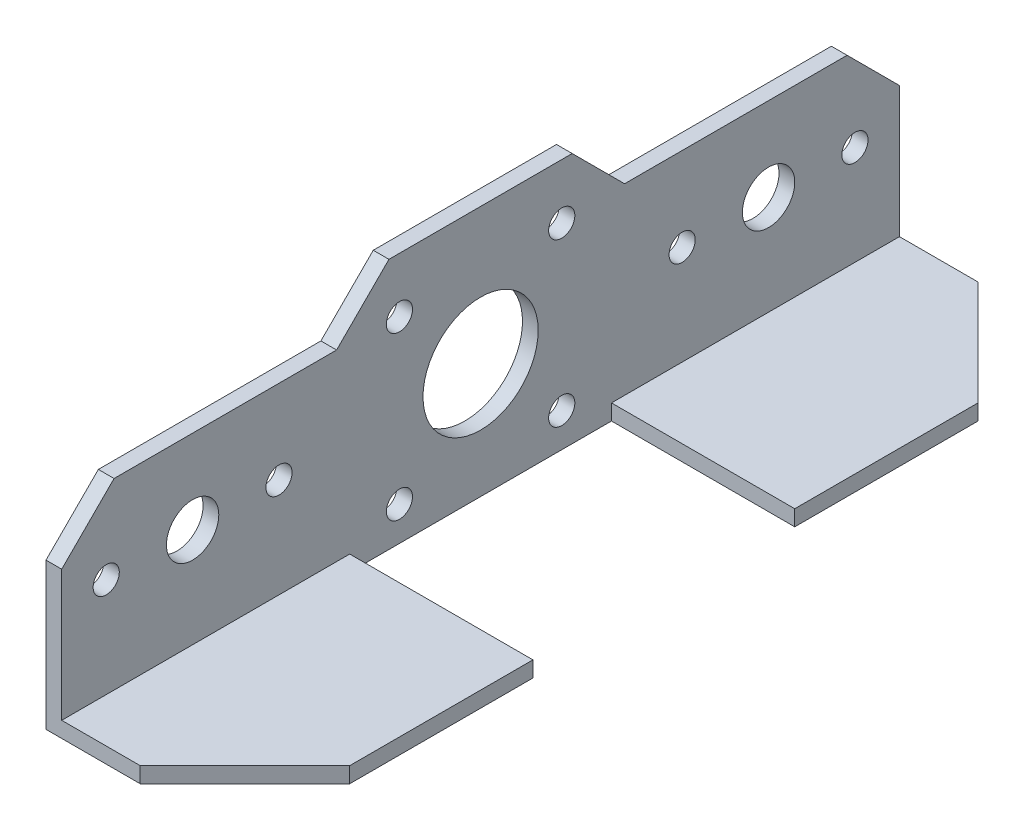
ISO-10303-21;
HEADER;
FILE_DESCRIPTION(('STEP AP214'),'2;1');
FILE_NAME('part.step','',(''),(''),'','','');
FILE_SCHEMA(('AUTOMOTIVE_DESIGN { 1 0 10303 214 1 1 1 1 }'));
ENDSEC;
DATA;
#1=APPLICATION_CONTEXT('core data for automotive mechanical design processes');
#2=APPLICATION_PROTOCOL_DEFINITION('international standard','automotive_design',2000,#1);
#3=PRODUCT_CONTEXT('',#1,'mechanical');
#4=PRODUCT('Part','Part','',(#3));
#5=PRODUCT_RELATED_PRODUCT_CATEGORY('part','',(#4));
#6=PRODUCT_DEFINITION_FORMATION('','',#4);
#7=PRODUCT_DEFINITION_CONTEXT('part definition',#1,'design');
#8=PRODUCT_DEFINITION('design','',#6,#7);
#9=PRODUCT_DEFINITION_SHAPE('','',#8);
#10=(LENGTH_UNIT() NAMED_UNIT(*) SI_UNIT(.MILLI.,.METRE.));
#11=(NAMED_UNIT(*) PLANE_ANGLE_UNIT() SI_UNIT($,.RADIAN.));
#12=(NAMED_UNIT(*) SI_UNIT($,.STERADIAN.) SOLID_ANGLE_UNIT());
#13=UNCERTAINTY_MEASURE_WITH_UNIT(LENGTH_MEASURE(1.E-05),#10,'distance_accuracy_value','');
#14=(GEOMETRIC_REPRESENTATION_CONTEXT(3) GLOBAL_UNCERTAINTY_ASSIGNED_CONTEXT((#13)) GLOBAL_UNIT_ASSIGNED_CONTEXT((#10,
#11,#12)) REPRESENTATION_CONTEXT('',''));
#15=CARTESIAN_POINT('',(0.,0.,0.));
#16=DIRECTION('',(0.,0.,1.));
#17=DIRECTION('',(1.,0.,0.));
#18=AXIS2_PLACEMENT_3D('',#15,#16,#17);
#19=CARTESIAN_POINT('',(1.66533453693773E-13,38.0000000000002,-79.9999999999998));
#20=DIRECTION('',(0.,1.00000000000001,0.));
#21=DIRECTION('',(0.,0.,1.));
#22=AXIS2_PLACEMENT_3D('',#19,#20,#21);
#23=PLANE('',#22);
#24=DIRECTION('',(0.,0.,1.));
#25=VECTOR('',#24,1.);
#26=CARTESIAN_POINT('',(1.66533453693773E-13,38.0000000000002,-79.9999999999998));
#27=LINE('',#26,#25);
#28=CARTESIAN_POINT('',(0.,38.0000000000002,27.5));
#29=VERTEX_POINT('',#28);
#30=CARTESIAN_POINT('',(-3.33066907387547E-13,38.0000000000002,70.));
#31=VERTEX_POINT('',#30);
#32=EDGE_CURVE('E192',#29,#31,#27,.T.);
#33=ORIENTED_EDGE('',*,*,#32,.T.);
#34=DIRECTION('',(1.00000000000001,0.,0.));
#35=VECTOR('',#34,1.);
#36=CARTESIAN_POINT('',(2.99999999999967,38.0000000000002,70.));
#37=LINE('',#36,#35);
#38=CARTESIAN_POINT('',(2.99999999999967,38.0000000000002,70.));
#39=VERTEX_POINT('',#38);
#40=EDGE_CURVE('E321',#31,#39,#37,.T.);
#41=ORIENTED_EDGE('',*,*,#40,.T.);
#42=DIRECTION('',(0.,0.,1.));
#43=VECTOR('',#42,1.);
#44=CARTESIAN_POINT('',(3.00000000000017,38.0000000000002,-79.9999999999997));
#45=LINE('',#44,#43);
#46=CARTESIAN_POINT('',(3.,38.0000000000002,27.5));
#47=VERTEX_POINT('',#46);
#48=EDGE_CURVE('E287',#47,#39,#45,.T.);
#49=ORIENTED_EDGE('',*,*,#48,.F.);
#50=DIRECTION('',(-1.00000000000001,0.,0.));
#51=VECTOR('',#50,1.);
#52=CARTESIAN_POINT('',(58.9016994374957,38.0000000000002,27.5000000000003));
#53=LINE('',#52,#51);
#54=EDGE_CURVE('E195',#47,#29,#53,.T.);
#55=ORIENTED_EDGE('',*,*,#54,.T.);
#56=EDGE_LOOP('',(#33,#41,#49,#55));
#57=FACE_BOUND('',#56,.T.);
#58=ADVANCED_FACE('F42',(#57),#23,.T.);
#59=CARTESIAN_POINT('',(3.00000000000017,3.,-79.9999999999997));
#60=DIRECTION('',(0.,1.00000000000001,0.));
#61=DIRECTION('',(0.,0.,1.));
#62=AXIS2_PLACEMENT_3D('',#59,#60,#61);
#63=PLANE('',#62);
#64=DIRECTION('',(-1.00000000000001,0.,0.));
#65=VECTOR('',#64,1.);
#66=CARTESIAN_POINT('',(3.,3.00000000000001,80.));
#67=LINE('',#66,#65);
#68=CARTESIAN_POINT('',(18.,3.00000000000001,80.));
#69=VERTEX_POINT('',#68);
#70=CARTESIAN_POINT('',(3.,3.00000000000001,80.));
#71=VERTEX_POINT('',#70);
#72=EDGE_CURVE('E265',#69,#71,#67,.T.);
#73=ORIENTED_EDGE('',*,*,#72,.F.);
#74=DIRECTION('',(0.707106781186549,0.,-0.707106781186549));
#75=VECTOR('',#74,1.);
#76=CARTESIAN_POINT('',(90.5000000000006,3.,7.50000000000001));
#77=LINE('',#76,#75);
#78=CARTESIAN_POINT('',(38.0000000000003,3.00000000000002,60.));
#79=VERTEX_POINT('',#78);
#80=EDGE_CURVE('E310',#69,#79,#77,.T.);
#81=ORIENTED_EDGE('',*,*,#80,.T.);
#82=DIRECTION('',(0.,0.,1.));
#83=VECTOR('',#82,1.);
#84=CARTESIAN_POINT('',(38.0000000000006,3.,-79.9999999999997));
#85=LINE('',#84,#83);
#86=CARTESIAN_POINT('',(38.0000000000003,3.00000000000006,25.0000000000001));
#87=VERTEX_POINT('',#86);
#88=EDGE_CURVE('E294',#87,#79,#85,.T.);
#89=ORIENTED_EDGE('',*,*,#88,.F.);
#90=DIRECTION('',(1.00000000000001,0.,0.));
#91=VECTOR('',#90,1.);
#92=CARTESIAN_POINT('',(3.,3.00000000000006,25.));
#93=LINE('',#92,#91);
#94=CARTESIAN_POINT('',(3.,3.00000000000006,25.));
#95=VERTEX_POINT('',#94);
#96=EDGE_CURVE('E239',#95,#87,#93,.T.);
#97=ORIENTED_EDGE('',*,*,#96,.F.);
#98=DIRECTION('',(0.,0.,1.));
#99=VECTOR('',#98,1.);
#100=CARTESIAN_POINT('',(3.00000000000017,3.,-79.9999999999997));
#101=LINE('',#100,#99);
#102=EDGE_CURVE('E291',#95,#71,#101,.T.);
#103=ORIENTED_EDGE('',*,*,#102,.T.);
#104=EDGE_LOOP('',(#73,#81,#89,#97,#103));
#105=FACE_BOUND('',#104,.T.);
#106=ADVANCED_FACE('F357',(#105),#63,.T.);
#107=CARTESIAN_POINT('',(38.0000000000006,3.,-79.9999999999997));
#108=DIRECTION('',(1.00000000000001,0.,0.));
#109=DIRECTION('',(0.,0.,-1.));
#110=AXIS2_PLACEMENT_3D('',#107,#108,#109);
#111=PLANE('',#110);
#112=ORIENTED_EDGE('',*,*,#88,.T.);
#113=DIRECTION('',(0.,-1.00000000000001,0.));
#114=VECTOR('',#113,1.);
#115=CARTESIAN_POINT('',(38.0000000000003,0.,60.0000000000005));
#116=LINE('',#115,#114);
#117=CARTESIAN_POINT('',(38.0000000000003,0.,60.0000000000005));
#118=VERTEX_POINT('',#117);
#119=EDGE_CURVE('E312',#79,#118,#116,.T.);
#120=ORIENTED_EDGE('',*,*,#119,.T.);
#121=DIRECTION('',(0.,0.,1.));
#122=VECTOR('',#121,1.);
#123=CARTESIAN_POINT('',(38.0000000000006,0.,-80.));
#124=LINE('',#123,#122);
#125=CARTESIAN_POINT('',(38.0000000000003,0.,25.0000000000006));
#126=VERTEX_POINT('',#125);
#127=EDGE_CURVE('E281',#126,#118,#124,.T.);
#128=ORIENTED_EDGE('',*,*,#127,.F.);
#129=DIRECTION('',(0.,1.00000000000001,0.));
#130=VECTOR('',#129,1.);
#131=CARTESIAN_POINT('',(38.0000000000003,-61.0327780786689,25.0000000000001));
#132=LINE('',#131,#130);
#133=EDGE_CURVE('E255',#126,#87,#132,.T.);
#134=ORIENTED_EDGE('',*,*,#133,.T.);
#135=EDGE_LOOP('',(#112,#120,#128,#134));
#136=FACE_BOUND('',#135,.T.);
#137=ADVANCED_FACE('F364',(#136),#111,.T.);
#138=CARTESIAN_POINT('',(1.66533453693773E-13,0.,-80.));
#139=DIRECTION('',(0.,-1.00000000000001,0.));
#140=DIRECTION('',(0.,0.,-1.));
#141=AXIS2_PLACEMENT_3D('',#138,#139,#140);
#142=PLANE('',#141);
#143=DIRECTION('',(1.00000000000001,0.,0.));
#144=VECTOR('',#143,1.);
#145=CARTESIAN_POINT('',(1.66533453693773E-13,0.,-80.));
#146=LINE('',#145,#144);
#147=CARTESIAN_POINT('',(1.66533453693773E-13,0.,-80.));
#148=VERTEX_POINT('',#147);
#149=CARTESIAN_POINT('',(18.0000000000001,0.,-80.));
#150=VERTEX_POINT('',#149);
#151=EDGE_CURVE('E272',#148,#150,#146,.T.);
#152=ORIENTED_EDGE('',*,*,#151,.T.);
#153=DIRECTION('',(-0.707106781186551,0.,-0.707106781186546));
#154=VECTOR('',#153,1.);
#155=CARTESIAN_POINT('',(8.99999999999959,0.,-89.));
#156=LINE('',#155,#154);
#157=CARTESIAN_POINT('',(38.0000000000003,0.,-60.));
#158=VERTEX_POINT('',#157);
#159=EDGE_CURVE('E305',#150,#158,#156,.F.);
#160=ORIENTED_EDGE('',*,*,#159,.T.);
#161=CARTESIAN_POINT('',(38.,0.,-25.));
#162=VERTEX_POINT('',#161);
#163=EDGE_CURVE('E295',#158,#162,#124,.T.);
#164=ORIENTED_EDGE('',*,*,#163,.T.);
#165=DIRECTION('',(-1.00000000000001,0.,0.));
#166=VECTOR('',#165,1.);
#167=CARTESIAN_POINT('',(2.99999999999981,0.,-24.9999999999997));
#168=LINE('',#167,#166);
#169=CARTESIAN_POINT('',(2.99999999999981,0.,-24.9999999999997));
#170=VERTEX_POINT('',#169);
#171=EDGE_CURVE('E247',#162,#170,#168,.T.);
#172=ORIENTED_EDGE('',*,*,#171,.T.);
#173=DIRECTION('',(0.,0.,1.));
#174=VECTOR('',#173,1.);
#175=CARTESIAN_POINT('',(2.99999999999981,0.,-24.9999999999997));
#176=LINE('',#175,#174);
#177=CARTESIAN_POINT('',(3.,0.,25.0000000000001));
#178=VERTEX_POINT('',#177);
#179=EDGE_CURVE('E241',#170,#178,#176,.T.);
#180=ORIENTED_EDGE('',*,*,#179,.T.);
#181=DIRECTION('',(1.00000000000001,0.,0.));
#182=VECTOR('',#181,1.);
#183=CARTESIAN_POINT('',(3.,0.,25.0000000000001));
#184=LINE('',#183,#182);
#185=EDGE_CURVE('E252',#178,#126,#184,.T.);
#186=ORIENTED_EDGE('',*,*,#185,.T.);
#187=ORIENTED_EDGE('',*,*,#127,.T.);
#188=DIRECTION('',(-0.707106781186549,0.,0.707106781186549));
#189=VECTOR('',#188,1.);
#190=CARTESIAN_POINT('',(89.0000000000003,0.,8.99999999999973));
#191=LINE('',#190,#189);
#192=CARTESIAN_POINT('',(18.,1.2490009027033E-13,80.0000000000001));
#193=VERTEX_POINT('',#192);
#194=EDGE_CURVE('E303',#118,#193,#191,.T.);
#195=ORIENTED_EDGE('',*,*,#194,.T.);
#196=DIRECTION('',(1.00000000000001,0.,0.));
#197=VECTOR('',#196,1.);
#198=CARTESIAN_POINT('',(0.,1.2490009027033E-13,80.0000000000006));
#199=LINE('',#198,#197);
#200=CARTESIAN_POINT('',(0.,1.2490009027033E-13,80.0000000000006));
#201=VERTEX_POINT('',#200);
#202=EDGE_CURVE('E262',#201,#193,#199,.T.);
#203=ORIENTED_EDGE('',*,*,#202,.F.);
#204=DIRECTION('',(0.,0.,1.));
#205=VECTOR('',#204,1.);
#206=CARTESIAN_POINT('',(1.66533453693773E-13,0.,-80.));
#207=LINE('',#206,#205);
#208=EDGE_CURVE('E191',#148,#201,#207,.T.);
#209=ORIENTED_EDGE('',*,*,#208,.F.);
#210=EDGE_LOOP('',(#152,#160,#164,#172,#180,#186,#187,#195,#203,#209));
#211=FACE_BOUND('',#210,.T.);
#212=ADVANCED_FACE('F369',(#211),#142,.T.);
#213=CARTESIAN_POINT('',(1.66533453693773E-13,0.,-80.));
#214=DIRECTION('',(-1.00000000000001,0.,0.));
#215=DIRECTION('',(0.,0.,1.));
#216=AXIS2_PLACEMENT_3D('',#213,#214,#215);
#217=PLANE('',#216);
#218=CARTESIAN_POINT('',(0.,22.0000000000001,1.66533453693773E-13));
#219=DIRECTION('',(-1.00000000000001,0.,0.));
#220=DIRECTION('',(0.,0.,1.));
#221=AXIS2_PLACEMENT_3D('',#218,#219,#220);
#222=CIRCLE('',#221,11.);
#223=CARTESIAN_POINT('',(0.,22.0000000000001,11.0000000000002));
#224=VERTEX_POINT('',#223);
#225=EDGE_CURVE('E511',#224,#224,#222,.T.);
#226=ORIENTED_EDGE('',*,*,#225,.F.);
#227=EDGE_LOOP('',(#226));
#228=FACE_BOUND('',#227,.T.);
#229=CARTESIAN_POINT('',(0.,6.5,-15.5));
#230=DIRECTION('',(-1.00000000000001,0.,0.));
#231=DIRECTION('',(0.,0.,1.));
#232=AXIS2_PLACEMENT_3D('',#229,#230,#231);
#233=CIRCLE('',#232,2.5);
#234=CARTESIAN_POINT('',(0.,6.5,-13.));
#235=VERTEX_POINT('',#234);
#236=EDGE_CURVE('E505',#235,#235,#233,.T.);
#237=ORIENTED_EDGE('',*,*,#236,.F.);
#238=EDGE_LOOP('',(#237));
#239=FACE_BOUND('',#238,.T.);
#240=CARTESIAN_POINT('',(1.66533453693773E-13,6.50000000000007,15.5000000000007));
#241=DIRECTION('',(-1.00000000000001,0.,0.));
#242=DIRECTION('',(0.,0.,1.));
#243=AXIS2_PLACEMENT_3D('',#240,#241,#242);
#244=CIRCLE('',#243,2.5);
#245=CARTESIAN_POINT('',(1.66533453702808E-13,6.50000000000007,18.0000000000007));
#246=VERTEX_POINT('',#245);
#247=EDGE_CURVE('E499',#246,#246,#244,.T.);
#248=ORIENTED_EDGE('',*,*,#247,.F.);
#249=EDGE_LOOP('',(#248));
#250=FACE_BOUND('',#249,.T.);
#251=CARTESIAN_POINT('',(1.66533453693773E-13,37.5000000000002,15.5));
#252=DIRECTION('',(-1.00000000000001,0.,0.));
#253=DIRECTION('',(0.,0.,1.));
#254=AXIS2_PLACEMENT_3D('',#251,#252,#253);
#255=CIRCLE('',#254,2.5);
#256=CARTESIAN_POINT('',(1.66533453702808E-13,37.5000000000002,18.));
#257=VERTEX_POINT('',#256);
#258=EDGE_CURVE('E486',#257,#257,#255,.T.);
#259=ORIENTED_EDGE('',*,*,#258,.F.);
#260=EDGE_LOOP('',(#259));
#261=FACE_BOUND('',#260,.T.);
#262=CARTESIAN_POINT('',(0.,37.5000000000002,-15.4999999999995));
#263=DIRECTION('',(-1.00000000000001,0.,0.));
#264=DIRECTION('',(0.,0.,1.));
#265=AXIS2_PLACEMENT_3D('',#262,#263,#264);
#266=CIRCLE('',#265,2.5);
#267=CARTESIAN_POINT('',(0.,37.5000000000002,-12.9999999999995));
#268=VERTEX_POINT('',#267);
#269=EDGE_CURVE('E491',#268,#268,#266,.T.);
#270=ORIENTED_EDGE('',*,*,#269,.F.);
#271=EDGE_LOOP('',(#270));
#272=FACE_BOUND('',#271,.T.);
#273=CARTESIAN_POINT('',(0.,22.0000000000001,-71.4999999999998));
#274=DIRECTION('',(-1.00000000000001,0.,0.));
#275=DIRECTION('',(0.,0.,1.));
#276=AXIS2_PLACEMENT_3D('',#273,#274,#275);
#277=CIRCLE('',#276,2.5);
#278=CARTESIAN_POINT('',(0.,22.0000000000001,-68.9999999999998));
#279=VERTEX_POINT('',#278);
#280=EDGE_CURVE('E226',#279,#279,#277,.F.);
#281=ORIENTED_EDGE('',*,*,#280,.T.);
#282=EDGE_LOOP('',(#281));
#283=FACE_BOUND('',#282,.T.);
#284=CARTESIAN_POINT('',(0.,22.0000000000001,-54.9999999999998));
#285=DIRECTION('',(-1.00000000000001,0.,0.));
#286=DIRECTION('',(0.,0.,1.));
#287=AXIS2_PLACEMENT_3D('',#284,#285,#286);
#288=CIRCLE('',#287,5.);
#289=CARTESIAN_POINT('',(0.,22.0000000000001,-49.9999999999998));
#290=VERTEX_POINT('',#289);
#291=EDGE_CURVE('E220',#290,#290,#288,.F.);
#292=ORIENTED_EDGE('',*,*,#291,.T.);
#293=EDGE_LOOP('',(#292));
#294=FACE_BOUND('',#293,.T.);
#295=CARTESIAN_POINT('',(0.,22.0000000000001,-38.4999999999998));
#296=DIRECTION('',(-1.00000000000001,0.,0.));
#297=DIRECTION('',(0.,0.,1.));
#298=AXIS2_PLACEMENT_3D('',#295,#296,#297);
#299=CIRCLE('',#298,2.5);
#300=CARTESIAN_POINT('',(0.,22.0000000000001,-35.9999999999998));
#301=VERTEX_POINT('',#300);
#302=EDGE_CURVE('E214',#301,#301,#299,.F.);
#303=ORIENTED_EDGE('',*,*,#302,.T.);
#304=EDGE_LOOP('',(#303));
#305=FACE_BOUND('',#304,.T.);
#306=CARTESIAN_POINT('',(-1.66533453693773E-13,22.0000000000001,38.5));
#307=DIRECTION('',(-1.00000000000001,0.,0.));
#308=DIRECTION('',(0.,0.,1.));
#309=AXIS2_PLACEMENT_3D('',#306,#307,#308);
#310=CIRCLE('',#309,2.5);
#311=CARTESIAN_POINT('',(-1.66533453684739E-13,22.0000000000001,41.));
#312=VERTEX_POINT('',#311);
#313=EDGE_CURVE('E207',#312,#312,#310,.F.);
#314=ORIENTED_EDGE('',*,*,#313,.T.);
#315=EDGE_LOOP('',(#314));
#316=FACE_BOUND('',#315,.T.);
#317=CARTESIAN_POINT('',(0.,22.0000000000001,71.5));
#318=DIRECTION('',(-1.00000000000001,0.,0.));
#319=DIRECTION('',(0.,0.,1.));
#320=AXIS2_PLACEMENT_3D('',#317,#318,#319);
#321=CIRCLE('',#320,2.5);
#322=CARTESIAN_POINT('',(0.,22.0000000000001,74.));
#323=VERTEX_POINT('',#322);
#324=EDGE_CURVE('E206',#323,#323,#321,.F.);
#325=ORIENTED_EDGE('',*,*,#324,.T.);
#326=EDGE_LOOP('',(#325));
#327=FACE_BOUND('',#326,.T.);
#328=CARTESIAN_POINT('',(1.66533453693773E-13,22.0000000000001,55.));
#329=DIRECTION('',(-1.00000000000001,0.,0.));
#330=DIRECTION('',(0.,0.,1.));
#331=AXIS2_PLACEMENT_3D('',#328,#329,#330);
#332=CIRCLE('',#331,5.);
#333=CARTESIAN_POINT('',(1.66533453711842E-13,22.0000000000001,60.));
#334=VERTEX_POINT('',#333);
#335=EDGE_CURVE('E235',#334,#334,#332,.F.);
#336=ORIENTED_EDGE('',*,*,#335,.T.);
#337=EDGE_LOOP('',(#336));
#338=FACE_BOUND('',#337,.T.);
#339=DIRECTION('',(0.,-1.00000000000001,0.));
#340=VECTOR('',#339,1.);
#341=CARTESIAN_POINT('',(0.,1.2490009027033E-13,80.0000000000006));
#342=LINE('',#341,#340);
#343=CARTESIAN_POINT('',(0.,28.0000000000002,79.9999999999997));
#344=VERTEX_POINT('',#343);
#345=EDGE_CURVE('E270',#344,#201,#342,.T.);
#346=ORIENTED_EDGE('',*,*,#345,.F.);
#347=DIRECTION('',(0.,0.707106781186549,-0.707106781186549));
#348=VECTOR('',#347,1.);
#349=CARTESIAN_POINT('',(-3.33066907387547E-13,94.0000000000007,14.0000000000002));
#350=LINE('',#349,#348);
#351=EDGE_CURVE('E319',#344,#31,#350,.T.);
#352=ORIENTED_EDGE('',*,*,#351,.T.);
#353=ORIENTED_EDGE('',*,*,#32,.F.);
#354=DIRECTION('',(0.,-0.707106781186549,0.707106781186548));
#355=VECTOR('',#354,1.);
#356=CARTESIAN_POINT('',(0.,72.7500000000004,-7.24999999999976));
#357=LINE('',#356,#355);
#358=CARTESIAN_POINT('',(1.66533453693773E-13,48.0000000000003,17.5000000000005));
#359=VERTEX_POINT('',#358);
#360=EDGE_CURVE('E181',#29,#359,#357,.F.);
#361=ORIENTED_EDGE('',*,*,#360,.T.);
#362=DIRECTION('',(0.,0.,-1.));
#363=VECTOR('',#362,1.);
#364=CARTESIAN_POINT('',(1.66533453693773E-13,48.0000000000002,-27.4999999999997));
#365=LINE('',#364,#363);
#366=CARTESIAN_POINT('',(-3.33066907387547E-13,48.0000000000003,-17.4999999999997));
#367=VERTEX_POINT('',#366);
#368=EDGE_CURVE('E176',#359,#367,#365,.T.);
#369=ORIENTED_EDGE('',*,*,#368,.T.);
#370=DIRECTION('',(0.,0.707106781186552,0.707106781186546));
#371=VECTOR('',#370,1.);
#372=CARTESIAN_POINT('',(-1.66533453693773E-13,-7.25000000000004,-72.7499999999996));
#373=LINE('',#372,#371);
#374=CARTESIAN_POINT('',(1.66533453693773E-13,38.0000000000002,-27.4999999999998));
#375=VERTEX_POINT('',#374);
#376=EDGE_CURVE('E170',#367,#375,#373,.F.);
#377=ORIENTED_EDGE('',*,*,#376,.T.);
#378=CARTESIAN_POINT('',(1.66533453693773E-13,38.0000000000002,-69.9999999999998));
#379=VERTEX_POINT('',#378);
#380=EDGE_CURVE('E174',#379,#375,#27,.T.);
#381=ORIENTED_EDGE('',*,*,#380,.F.);
#382=DIRECTION('',(0.,0.707106781186552,0.707106781186546));
#383=VECTOR('',#382,1.);
#384=CARTESIAN_POINT('',(1.66533453693773E-13,14.,-93.9999999999998));
#385=LINE('',#384,#383);
#386=CARTESIAN_POINT('',(1.66533453693773E-13,28.0000000000002,-80.));
#387=VERTEX_POINT('',#386);
#388=EDGE_CURVE('E180',#379,#387,#385,.F.);
#389=ORIENTED_EDGE('',*,*,#388,.T.);
#390=DIRECTION('',(0.,-1.00000000000001,0.));
#391=VECTOR('',#390,1.);
#392=CARTESIAN_POINT('',(1.66533453693773E-13,0.,-80.));
#393=LINE('',#392,#391);
#394=EDGE_CURVE('E279',#387,#148,#393,.T.);
#395=ORIENTED_EDGE('',*,*,#394,.T.);
#396=ORIENTED_EDGE('',*,*,#208,.T.);
#397=EDGE_LOOP('',(#346,#352,#353,#361,#369,#377,#381,#389,#395,#396));
#398=FACE_BOUND('',#397,.T.);
#399=ADVANCED_FACE('F173',(#228,#239,#250,#261,#272,#283,#294,#305,#316,#327,#338,#398),#217,.T.);
#400=CARTESIAN_POINT('',(3.00000000000014,38.0000000000002,-69.9999999999997));
#401=VERTEX_POINT('',#400);
#402=CARTESIAN_POINT('',(3.00000000000017,38.0000000000002,-27.4999999999996));
#403=VERTEX_POINT('',#402);
#404=EDGE_CURVE('E285',#401,#403,#45,.T.);
#405=ORIENTED_EDGE('',*,*,#404,.F.);
#406=DIRECTION('',(-1.00000000000001,0.,0.));
#407=VECTOR('',#406,1.);
#408=CARTESIAN_POINT('',(1.66533453693773E-13,38.0000000000002,-69.9999999999998));
#409=LINE('',#408,#407);
#410=EDGE_CURVE('E190',#401,#379,#409,.T.);
#411=ORIENTED_EDGE('',*,*,#410,.T.);
#412=ORIENTED_EDGE('',*,*,#380,.T.);
#413=DIRECTION('',(-1.00000000000001,0.,0.));
#414=VECTOR('',#413,1.);
#415=CARTESIAN_POINT('',(58.9016994374953,38.0000000000002,-27.5));
#416=LINE('',#415,#414);
#417=EDGE_CURVE('E188',#403,#375,#416,.T.);
#418=ORIENTED_EDGE('',*,*,#417,.F.);
#419=EDGE_LOOP('',(#405,#411,#412,#418));
#420=FACE_BOUND('',#419,.T.);
#421=ADVANCED_FACE('F187',(#420),#23,.T.);
#422=CARTESIAN_POINT('',(3.00000000000017,3.,-79.9999999999997));
#423=DIRECTION('',(1.00000000000001,0.,0.));
#424=DIRECTION('',(0.,0.,-1.));
#425=AXIS2_PLACEMENT_3D('',#422,#423,#424);
#426=PLANE('',#425);
#427=CARTESIAN_POINT('',(3.,22.0000000000001,4.71844785465692E-13));
#428=DIRECTION('',(1.00000000000001,0.,0.));
#429=DIRECTION('',(0.,0.,-1.));
#430=AXIS2_PLACEMENT_3D('',#427,#428,#429);
#431=CIRCLE('',#430,11.);
#432=CARTESIAN_POINT('',(3.,22.0000000000001,-10.9999999999995));
#433=VERTEX_POINT('',#432);
#434=EDGE_CURVE('E508',#433,#433,#431,.F.);
#435=ORIENTED_EDGE('',*,*,#434,.T.);
#436=EDGE_LOOP('',(#435));
#437=FACE_BOUND('',#436,.T.);
#438=CARTESIAN_POINT('',(3.,6.5,-15.4999999999997));
#439=DIRECTION('',(1.00000000000001,0.,0.));
#440=DIRECTION('',(0.,0.,-1.));
#441=AXIS2_PLACEMENT_3D('',#438,#439,#440);
#442=CIRCLE('',#441,2.5);
#443=CARTESIAN_POINT('',(3.,6.5,-17.9999999999997));
#444=VERTEX_POINT('',#443);
#445=EDGE_CURVE('E502',#444,#444,#442,.F.);
#446=ORIENTED_EDGE('',*,*,#445,.T.);
#447=EDGE_LOOP('',(#446));
#448=FACE_BOUND('',#447,.T.);
#449=CARTESIAN_POINT('',(3.00000000000017,6.50000000000007,15.5000000000007));
#450=DIRECTION('',(1.00000000000001,0.,0.));
#451=DIRECTION('',(0.,0.,-1.));
#452=AXIS2_PLACEMENT_3D('',#449,#450,#451);
#453=CIRCLE('',#452,2.5);
#454=CARTESIAN_POINT('',(3.00000000000017,6.50000000000007,13.0000000000007));
#455=VERTEX_POINT('',#454);
#456=EDGE_CURVE('E496',#455,#455,#453,.F.);
#457=ORIENTED_EDGE('',*,*,#456,.T.);
#458=EDGE_LOOP('',(#457));
#459=FACE_BOUND('',#458,.T.);
#460=CARTESIAN_POINT('',(3.00000000000017,37.5000000000002,15.5));
#461=DIRECTION('',(1.00000000000001,0.,0.));
#462=DIRECTION('',(0.,0.,-1.));
#463=AXIS2_PLACEMENT_3D('',#460,#461,#462);
#464=CIRCLE('',#463,2.5);
#465=CARTESIAN_POINT('',(3.00000000000017,37.5000000000002,13.));
#466=VERTEX_POINT('',#465);
#467=EDGE_CURVE('E489',#466,#466,#464,.F.);
#468=ORIENTED_EDGE('',*,*,#467,.T.);
#469=EDGE_LOOP('',(#468));
#470=FACE_BOUND('',#469,.T.);
#471=CARTESIAN_POINT('',(3.,37.5000000000002,-15.4999999999995));
#472=DIRECTION('',(1.00000000000001,0.,0.));
#473=DIRECTION('',(0.,0.,-1.));
#474=AXIS2_PLACEMENT_3D('',#471,#472,#473);
#475=CIRCLE('',#474,2.5);
#476=CARTESIAN_POINT('',(3.,37.5000000000002,-17.9999999999995));
#477=VERTEX_POINT('',#476);
#478=EDGE_CURVE('E494',#477,#477,#475,.F.);
#479=ORIENTED_EDGE('',*,*,#478,.T.);
#480=EDGE_LOOP('',(#479));
#481=FACE_BOUND('',#480,.T.);
#482=CARTESIAN_POINT('',(3.,22.0000000000001,-71.4999999999997));
#483=DIRECTION('',(1.00000000000001,0.,0.));
#484=DIRECTION('',(0.,0.,1.));
#485=AXIS2_PLACEMENT_3D('',#482,#483,#484);
#486=CIRCLE('',#485,2.5);
#487=CARTESIAN_POINT('',(3.,22.0000000000001,-68.9999999999997));
#488=VERTEX_POINT('',#487);
#489=EDGE_CURVE('E199',#488,#488,#486,.T.);
#490=ORIENTED_EDGE('',*,*,#489,.F.);
#491=EDGE_LOOP('',(#490));
#492=FACE_BOUND('',#491,.T.);
#493=CARTESIAN_POINT('',(3.,22.0000000000001,-54.9999999999995));
#494=DIRECTION('',(1.00000000000001,0.,0.));
#495=DIRECTION('',(0.,0.,1.));
#496=AXIS2_PLACEMENT_3D('',#493,#494,#495);
#497=CIRCLE('',#496,5.);
#498=CARTESIAN_POINT('',(3.,22.0000000000001,-49.9999999999995));
#499=VERTEX_POINT('',#498);
#500=EDGE_CURVE('E223',#499,#499,#497,.T.);
#501=ORIENTED_EDGE('',*,*,#500,.F.);
#502=EDGE_LOOP('',(#501));
#503=FACE_BOUND('',#502,.T.);
#504=CARTESIAN_POINT('',(3.,22.0000000000001,-38.4999999999995));
#505=DIRECTION('',(1.00000000000001,0.,0.));
#506=DIRECTION('',(0.,0.,1.));
#507=AXIS2_PLACEMENT_3D('',#504,#505,#506);
#508=CIRCLE('',#507,2.5);
#509=CARTESIAN_POINT('',(3.,22.0000000000001,-35.9999999999995));
#510=VERTEX_POINT('',#509);
#511=EDGE_CURVE('E217',#510,#510,#508,.T.);
#512=ORIENTED_EDGE('',*,*,#511,.F.);
#513=EDGE_LOOP('',(#512));
#514=FACE_BOUND('',#513,.T.);
#515=CARTESIAN_POINT('',(2.99999999999981,22.0000000000001,38.5));
#516=DIRECTION('',(1.00000000000001,0.,0.));
#517=DIRECTION('',(0.,0.,-1.));
#518=AXIS2_PLACEMENT_3D('',#515,#516,#517);
#519=CIRCLE('',#518,2.5);
#520=CARTESIAN_POINT('',(2.99999999999981,22.0000000000001,36.));
#521=VERTEX_POINT('',#520);
#522=EDGE_CURVE('E211',#521,#521,#519,.T.);
#523=ORIENTED_EDGE('',*,*,#522,.F.);
#524=EDGE_LOOP('',(#523));
#525=FACE_BOUND('',#524,.T.);
#526=CARTESIAN_POINT('',(3.,22.0000000000001,71.5));
#527=DIRECTION('',(1.00000000000001,0.,0.));
#528=DIRECTION('',(0.,0.,-1.));
#529=AXIS2_PLACEMENT_3D('',#526,#527,#528);
#530=CIRCLE('',#529,2.5);
#531=CARTESIAN_POINT('',(3.,22.0000000000001,69.));
#532=VERTEX_POINT('',#531);
#533=EDGE_CURVE('E203',#532,#532,#530,.T.);
#534=ORIENTED_EDGE('',*,*,#533,.F.);
#535=EDGE_LOOP('',(#534));
#536=FACE_BOUND('',#535,.T.);
#537=CARTESIAN_POINT('',(3.00000000000017,22.0000000000001,55.));
#538=DIRECTION('',(1.00000000000001,0.,0.));
#539=DIRECTION('',(0.,0.,-1.));
#540=AXIS2_PLACEMENT_3D('',#537,#538,#539);
#541=CIRCLE('',#540,5.);
#542=CARTESIAN_POINT('',(3.00000000000017,22.0000000000001,50.));
#543=VERTEX_POINT('',#542);
#544=EDGE_CURVE('E210',#543,#543,#541,.T.);
#545=ORIENTED_EDGE('',*,*,#544,.F.);
#546=EDGE_LOOP('',(#545));
#547=FACE_BOUND('',#546,.T.);
#548=ORIENTED_EDGE('',*,*,#48,.T.);
#549=DIRECTION('',(0.,-0.707106781186549,0.707106781186549));
#550=VECTOR('',#549,1.);
#551=CARTESIAN_POINT('',(3.00000000000017,95.5000000000007,12.4999999999998));
#552=LINE('',#551,#550);
#553=CARTESIAN_POINT('',(3.,28.0000000000002,80.));
#554=VERTEX_POINT('',#553);
#555=EDGE_CURVE('E328',#39,#554,#552,.T.);
#556=ORIENTED_EDGE('',*,*,#555,.T.);
#557=DIRECTION('',(0.,1.00000000000001,0.));
#558=VECTOR('',#557,1.);
#559=CARTESIAN_POINT('',(3.,3.00000000000001,80.));
#560=LINE('',#559,#558);
#561=EDGE_CURVE('E267',#71,#554,#560,.T.);
#562=ORIENTED_EDGE('',*,*,#561,.F.);
#563=ORIENTED_EDGE('',*,*,#102,.F.);
#564=DIRECTION('',(0.,1.00000000000001,0.));
#565=VECTOR('',#564,1.);
#566=CARTESIAN_POINT('',(3.,-61.0327780786689,25.0000000000001));
#567=LINE('',#566,#565);
#568=EDGE_CURVE('E246',#178,#95,#567,.T.);
#569=ORIENTED_EDGE('',*,*,#568,.F.);
#570=ORIENTED_EDGE('',*,*,#179,.F.);
#571=DIRECTION('',(0.,1.00000000000001,0.));
#572=VECTOR('',#571,1.);
#573=CARTESIAN_POINT('',(2.99999999999981,-61.0327780786689,-24.9999999999997));
#574=LINE('',#573,#572);
#575=CARTESIAN_POINT('',(2.99999999999981,3.00000000000002,-24.9999999999997));
#576=VERTEX_POINT('',#575);
#577=EDGE_CURVE('E250',#170,#576,#574,.T.);
#578=ORIENTED_EDGE('',*,*,#577,.T.);
#579=CARTESIAN_POINT('',(3.00000000000017,3.,-79.9999999999997));
#580=VERTEX_POINT('',#579);
#581=EDGE_CURVE('E288',#580,#576,#101,.T.);
#582=ORIENTED_EDGE('',*,*,#581,.F.);
#583=DIRECTION('',(0.,1.00000000000001,0.));
#584=VECTOR('',#583,1.);
#585=CARTESIAN_POINT('',(3.00000000000017,3.,-79.9999999999997));
#586=LINE('',#585,#584);
#587=CARTESIAN_POINT('',(3.00000000000017,28.0000000000002,-79.9999999999999));
#588=VERTEX_POINT('',#587);
#589=EDGE_CURVE('E277',#580,#588,#586,.T.);
#590=ORIENTED_EDGE('',*,*,#589,.T.);
#591=DIRECTION('',(0.,-0.707106781186552,-0.707106781186546));
#592=VECTOR('',#591,1.);
#593=CARTESIAN_POINT('',(2.99999999999967,15.5,-92.4999999999997));
#594=LINE('',#593,#592);
#595=EDGE_CURVE('E326',#588,#401,#594,.F.);
#596=ORIENTED_EDGE('',*,*,#595,.T.);
#597=ORIENTED_EDGE('',*,*,#404,.T.);
#598=DIRECTION('',(0.,-0.707106781186552,-0.707106781186546));
#599=VECTOR('',#598,1.);
#600=CARTESIAN_POINT('',(3.,-5.75000000000004,-71.2499999999996));
#601=LINE('',#600,#599);
#602=CARTESIAN_POINT('',(2.99999999999967,48.0000000000003,-17.4999999999994));
#603=VERTEX_POINT('',#602);
#604=EDGE_CURVE('E65',#403,#603,#601,.F.);
#605=ORIENTED_EDGE('',*,*,#604,.T.);
#606=DIRECTION('',(0.,0.,-1.));
#607=VECTOR('',#606,1.);
#608=CARTESIAN_POINT('',(3.00000000000017,48.0000000000002,-27.4999999999994));
#609=LINE('',#608,#607);
#610=CARTESIAN_POINT('',(3.00000000000017,48.0000000000003,17.5000000000001));
#611=VERTEX_POINT('',#610);
#612=EDGE_CURVE('E196',#611,#603,#609,.T.);
#613=ORIENTED_EDGE('',*,*,#612,.F.);
#614=DIRECTION('',(0.,0.707106781186549,-0.707106781186548));
#615=VECTOR('',#614,1.);
#616=CARTESIAN_POINT('',(3.00000000000017,74.2500000000004,-8.74999999999981));
#617=LINE('',#616,#615);
#618=EDGE_CURVE('E323',#611,#47,#617,.F.);
#619=ORIENTED_EDGE('',*,*,#618,.T.);
#620=EDGE_LOOP('',(#548,#556,#562,#563,#569,#570,#578,#582,#590,#596,#597,#605,#613,#619));
#621=FACE_BOUND('',#620,.T.);
#622=ADVANCED_FACE('F337',(#437,#448,#459,#470,#481,#492,#503,#514,#525,#536,#547,#621),#426,.T.);
#623=CARTESIAN_POINT('',(38.0000000000003,3.00000000000003,-59.9999999999997));
#624=VERTEX_POINT('',#623);
#625=CARTESIAN_POINT('',(38.,3.00000000000002,-24.9999999999997));
#626=VERTEX_POINT('',#625);
#627=EDGE_CURVE('E292',#624,#626,#85,.T.);
#628=ORIENTED_EDGE('',*,*,#627,.F.);
#629=DIRECTION('',(0.707106781186551,0.,0.707106781186546));
#630=VECTOR('',#629,1.);
#631=CARTESIAN_POINT('',(10.4999999999999,3.00000000000002,-87.4999999999996));
#632=LINE('',#631,#630);
#633=CARTESIAN_POINT('',(18.0000000000001,3.,-79.9999999999997));
#634=VERTEX_POINT('',#633);
#635=EDGE_CURVE('E299',#624,#634,#632,.F.);
#636=ORIENTED_EDGE('',*,*,#635,.T.);
#637=DIRECTION('',(-1.00000000000001,0.,0.));
#638=VECTOR('',#637,1.);
#639=CARTESIAN_POINT('',(3.00000000000017,3.,-79.9999999999997));
#640=LINE('',#639,#638);
#641=EDGE_CURVE('E275',#634,#580,#640,.T.);
#642=ORIENTED_EDGE('',*,*,#641,.T.);
#643=ORIENTED_EDGE('',*,*,#581,.T.);
#644=DIRECTION('',(-1.00000000000001,0.,0.));
#645=VECTOR('',#644,1.);
#646=CARTESIAN_POINT('',(2.99999999999981,3.00000000000002,-24.9999999999997));
#647=LINE('',#646,#645);
#648=EDGE_CURVE('E238',#626,#576,#647,.T.);
#649=ORIENTED_EDGE('',*,*,#648,.F.);
#650=EDGE_LOOP('',(#628,#636,#642,#643,#649));
#651=FACE_BOUND('',#650,.T.);
#652=ADVANCED_FACE('F394',(#651),#63,.T.);
#653=ORIENTED_EDGE('',*,*,#163,.F.);
#654=DIRECTION('',(0.,1.00000000000001,0.));
#655=VECTOR('',#654,1.);
#656=CARTESIAN_POINT('',(38.0000000000003,3.00000000000003,-59.9999999999997));
#657=LINE('',#656,#655);
#658=EDGE_CURVE('E283',#158,#624,#657,.T.);
#659=ORIENTED_EDGE('',*,*,#658,.T.);
#660=ORIENTED_EDGE('',*,*,#627,.T.);
#661=DIRECTION('',(0.,1.00000000000001,0.));
#662=VECTOR('',#661,1.);
#663=CARTESIAN_POINT('',(38.,-61.0327780786689,-24.9999999999997));
#664=LINE('',#663,#662);
#665=EDGE_CURVE('E251',#162,#626,#664,.T.);
#666=ORIENTED_EDGE('',*,*,#665,.F.);
#667=EDGE_LOOP('',(#653,#659,#660,#666));
#668=FACE_BOUND('',#667,.T.);
#669=ADVANCED_FACE('F387',(#668),#111,.T.);
#670=CARTESIAN_POINT('',(1.66533453693773E-13,0.,-80.));
#671=DIRECTION('',(0.,0.,-1.));
#672=DIRECTION('',(-1.00000000000001,0.,0.));
#673=AXIS2_PLACEMENT_3D('',#670,#671,#672);
#674=PLANE('',#673);
#675=ORIENTED_EDGE('',*,*,#394,.F.);
#676=DIRECTION('',(1.00000000000001,0.,0.));
#677=VECTOR('',#676,1.);
#678=CARTESIAN_POINT('',(1.66533453693773E-13,28.0000000000002,-80.));
#679=LINE('',#678,#677);
#680=EDGE_CURVE('E57',#387,#588,#679,.T.);
#681=ORIENTED_EDGE('',*,*,#680,.T.);
#682=ORIENTED_EDGE('',*,*,#589,.F.);
#683=ORIENTED_EDGE('',*,*,#641,.F.);
#684=DIRECTION('',(0.,-1.00000000000001,0.));
#685=VECTOR('',#684,1.);
#686=CARTESIAN_POINT('',(18.0000000000001,0.,-80.));
#687=LINE('',#686,#685);
#688=EDGE_CURVE('E301',#634,#150,#687,.T.);
#689=ORIENTED_EDGE('',*,*,#688,.T.);
#690=ORIENTED_EDGE('',*,*,#151,.F.);
#691=EDGE_LOOP('',(#675,#681,#682,#683,#689,#690));
#692=FACE_BOUND('',#691,.T.);
#693=ADVANCED_FACE('F377',(#692),#674,.T.);
#694=CARTESIAN_POINT('',(0.,1.2490009027033E-13,80.0000000000006));
#695=DIRECTION('',(0.,0.,-1.));
#696=DIRECTION('',(-1.00000000000001,0.,0.));
#697=AXIS2_PLACEMENT_3D('',#694,#695,#696);
#698=PLANE('',#697);
#699=ORIENTED_EDGE('',*,*,#561,.T.);
#700=DIRECTION('',(-1.00000000000001,0.,0.));
#701=VECTOR('',#700,1.);
#702=CARTESIAN_POINT('',(0.,28.0000000000002,79.9999999999997));
#703=LINE('',#702,#701);
#704=EDGE_CURVE('E314',#554,#344,#703,.T.);
#705=ORIENTED_EDGE('',*,*,#704,.T.);
#706=ORIENTED_EDGE('',*,*,#345,.T.);
#707=ORIENTED_EDGE('',*,*,#202,.T.);
#708=DIRECTION('',(0.,1.00000000000001,0.));
#709=VECTOR('',#708,1.);
#710=CARTESIAN_POINT('',(18.,3.00000000000001,80.));
#711=LINE('',#710,#709);
#712=EDGE_CURVE('E307',#193,#69,#711,.T.);
#713=ORIENTED_EDGE('',*,*,#712,.T.);
#714=ORIENTED_EDGE('',*,*,#72,.T.);
#715=EDGE_LOOP('',(#699,#705,#706,#707,#713,#714));
#716=FACE_BOUND('',#715,.T.);
#717=ADVANCED_FACE('F349',(#716),#698,.F.);
#718=CARTESIAN_POINT('',(3.,-61.0327780786689,25.0000000000001));
#719=DIRECTION('',(0.,0.,1.));
#720=DIRECTION('',(1.00000000000001,0.,0.));
#721=AXIS2_PLACEMENT_3D('',#718,#719,#720);
#722=PLANE('',#721);
#723=ORIENTED_EDGE('',*,*,#568,.T.);
#724=ORIENTED_EDGE('',*,*,#96,.T.);
#725=ORIENTED_EDGE('',*,*,#133,.F.);
#726=ORIENTED_EDGE('',*,*,#185,.F.);
#727=EDGE_LOOP('',(#723,#724,#725,#726));
#728=FACE_BOUND('',#727,.T.);
#729=ADVANCED_FACE('F361',(#728),#722,.F.);
#730=CARTESIAN_POINT('',(2.99999999999981,-61.0327780786689,-24.9999999999997));
#731=DIRECTION('',(0.,0.,-1.));
#732=DIRECTION('',(-1.00000000000001,0.,0.));
#733=AXIS2_PLACEMENT_3D('',#730,#731,#732);
#734=PLANE('',#733);
#735=ORIENTED_EDGE('',*,*,#665,.T.);
#736=ORIENTED_EDGE('',*,*,#648,.T.);
#737=ORIENTED_EDGE('',*,*,#577,.F.);
#738=ORIENTED_EDGE('',*,*,#171,.F.);
#739=EDGE_LOOP('',(#735,#736,#737,#738));
#740=FACE_BOUND('',#739,.T.);
#741=ADVANCED_FACE('F391',(#740),#734,.F.);
#742=CARTESIAN_POINT('',(38.0000000000003,3.00000000000003,-59.9999999999997));
#743=DIRECTION('',(-0.707106781186549,0.,0.707106781186549));
#744=DIRECTION('',(0.,1.00000000000001,0.));
#745=AXIS2_PLACEMENT_3D('',#742,#743,#744);
#746=PLANE('',#745);
#747=ORIENTED_EDGE('',*,*,#159,.F.);
#748=ORIENTED_EDGE('',*,*,#688,.F.);
#749=ORIENTED_EDGE('',*,*,#635,.F.);
#750=ORIENTED_EDGE('',*,*,#658,.F.);
#751=EDGE_LOOP('',(#747,#748,#749,#750));
#752=FACE_BOUND('',#751,.T.);
#753=ADVANCED_FACE('F381',(#752),#746,.F.);
#754=CARTESIAN_POINT('',(18.,1.2490009027033E-13,80.0000000000001));
#755=DIRECTION('',(0.707106781186552,0.,0.707106781186546));
#756=DIRECTION('',(0.,-1.00000000000001,0.));
#757=AXIS2_PLACEMENT_3D('',#754,#755,#756);
#758=PLANE('',#757);
#759=ORIENTED_EDGE('',*,*,#194,.F.);
#760=ORIENTED_EDGE('',*,*,#119,.F.);
#761=ORIENTED_EDGE('',*,*,#80,.F.);
#762=ORIENTED_EDGE('',*,*,#712,.F.);
#763=EDGE_LOOP('',(#759,#760,#761,#762));
#764=FACE_BOUND('',#763,.T.);
#765=ADVANCED_FACE('F373',(#764),#758,.T.);
#766=CARTESIAN_POINT('',(-14.1421356237308,22.0000000000001,54.9999999999999));
#767=DIRECTION('',(1.00000000000001,0.,0.));
#768=DIRECTION('',(0.,0.,-1.));
#769=AXIS2_PLACEMENT_3D('',#766,#767,#768);
#770=CYLINDRICAL_SURFACE('',#769,5.);
#771=ORIENTED_EDGE('',*,*,#544,.T.);
#772=EDGE_LOOP('',(#771));
#773=FACE_BOUND('',#772,.T.);
#774=ORIENTED_EDGE('',*,*,#335,.F.);
#775=EDGE_LOOP('',(#774));
#776=FACE_BOUND('',#775,.T.);
#777=ADVANCED_FACE('F437',(#773,#776),#770,.F.);
#778=CARTESIAN_POINT('',(-14.142135623731,22.0000000000001,71.5));
#779=DIRECTION('',(1.00000000000001,0.,0.));
#780=DIRECTION('',(0.,0.,-1.));
#781=AXIS2_PLACEMENT_3D('',#778,#779,#780);
#782=CYLINDRICAL_SURFACE('',#781,2.5);
#783=ORIENTED_EDGE('',*,*,#533,.T.);
#784=EDGE_LOOP('',(#783));
#785=FACE_BOUND('',#784,.T.);
#786=ORIENTED_EDGE('',*,*,#324,.F.);
#787=EDGE_LOOP('',(#786));
#788=FACE_BOUND('',#787,.T.);
#789=ADVANCED_FACE('F440',(#785,#788),#782,.F.);
#790=CARTESIAN_POINT('',(-14.1421356237313,22.0000000000001,38.5));
#791=DIRECTION('',(1.00000000000001,0.,0.));
#792=DIRECTION('',(0.,0.,-1.));
#793=AXIS2_PLACEMENT_3D('',#790,#791,#792);
#794=CYLINDRICAL_SURFACE('',#793,2.5);
#795=ORIENTED_EDGE('',*,*,#522,.T.);
#796=EDGE_LOOP('',(#795));
#797=FACE_BOUND('',#796,.T.);
#798=ORIENTED_EDGE('',*,*,#313,.F.);
#799=EDGE_LOOP('',(#798));
#800=FACE_BOUND('',#799,.T.);
#801=ADVANCED_FACE('F453',(#797,#800),#794,.F.);
#802=CARTESIAN_POINT('',(-14.1421356237309,22.0000000000001,-38.4999999999995));
#803=DIRECTION('',(1.00000000000001,0.,0.));
#804=DIRECTION('',(0.,0.,-1.));
#805=AXIS2_PLACEMENT_3D('',#802,#803,#804);
#806=CYLINDRICAL_SURFACE('',#805,2.5);
#807=ORIENTED_EDGE('',*,*,#511,.T.);
#808=EDGE_LOOP('',(#807));
#809=FACE_BOUND('',#808,.T.);
#810=ORIENTED_EDGE('',*,*,#302,.F.);
#811=EDGE_LOOP('',(#810));
#812=FACE_BOUND('',#811,.T.);
#813=ADVANCED_FACE('F449',(#809,#812),#806,.F.);
#814=CARTESIAN_POINT('',(-14.1421356237309,22.0000000000001,-54.9999999999995));
#815=DIRECTION('',(1.00000000000001,0.,0.));
#816=DIRECTION('',(0.,0.,-1.));
#817=AXIS2_PLACEMENT_3D('',#814,#815,#816);
#818=CYLINDRICAL_SURFACE('',#817,5.);
#819=ORIENTED_EDGE('',*,*,#500,.T.);
#820=EDGE_LOOP('',(#819));
#821=FACE_BOUND('',#820,.T.);
#822=ORIENTED_EDGE('',*,*,#291,.F.);
#823=EDGE_LOOP('',(#822));
#824=FACE_BOUND('',#823,.T.);
#825=ADVANCED_FACE('F445',(#821,#824),#818,.F.);
#826=CARTESIAN_POINT('',(-14.142135623731,22.0000000000001,-71.4999999999995));
#827=DIRECTION('',(1.00000000000001,0.,0.));
#828=DIRECTION('',(0.,0.,-1.));
#829=AXIS2_PLACEMENT_3D('',#826,#827,#828);
#830=CYLINDRICAL_SURFACE('',#829,2.5);
#831=ORIENTED_EDGE('',*,*,#489,.T.);
#832=EDGE_LOOP('',(#831));
#833=FACE_BOUND('',#832,.T.);
#834=ORIENTED_EDGE('',*,*,#280,.F.);
#835=EDGE_LOOP('',(#834));
#836=FACE_BOUND('',#835,.T.);
#837=ADVANCED_FACE('F442',(#833,#836),#830,.F.);
#838=CARTESIAN_POINT('',(58.9016994374953,48.0000000000002,-27.4999999999997));
#839=DIRECTION('',(0.,1.00000000000001,0.));
#840=DIRECTION('',(0.,0.,1.));
#841=AXIS2_PLACEMENT_3D('',#838,#839,#840);
#842=PLANE('',#841);
#843=ORIENTED_EDGE('',*,*,#612,.T.);
#844=DIRECTION('',(-1.00000000000001,0.,0.));
#845=VECTOR('',#844,1.);
#846=CARTESIAN_POINT('',(58.9016994374951,48.0000000000003,-17.4999999999997));
#847=LINE('',#846,#845);
#848=EDGE_CURVE('E11',#603,#367,#847,.T.);
#849=ORIENTED_EDGE('',*,*,#848,.T.);
#850=ORIENTED_EDGE('',*,*,#368,.F.);
#851=DIRECTION('',(1.00000000000001,0.,0.));
#852=VECTOR('',#851,1.);
#853=CARTESIAN_POINT('',(58.901699437495,48.0000000000003,17.5000000000001));
#854=LINE('',#853,#852);
#855=EDGE_CURVE('E50',#359,#611,#854,.T.);
#856=ORIENTED_EDGE('',*,*,#855,.T.);
#857=EDGE_LOOP('',(#843,#849,#850,#856));
#858=FACE_BOUND('',#857,.T.);
#859=ADVANCED_FACE('F333',(#858),#842,.T.);
#860=CARTESIAN_POINT('',(34.1126983722084,37.5000000000002,-15.4999999999995));
#861=DIRECTION('',(-1.00000000000001,0.,0.));
#862=DIRECTION('',(0.,0.,1.));
#863=AXIS2_PLACEMENT_3D('',#860,#861,#862);
#864=CYLINDRICAL_SURFACE('',#863,2.5);
#865=ORIENTED_EDGE('',*,*,#269,.T.);
#866=EDGE_LOOP('',(#865));
#867=FACE_BOUND('',#866,.T.);
#868=ORIENTED_EDGE('',*,*,#478,.F.);
#869=EDGE_LOOP('',(#868));
#870=FACE_BOUND('',#869,.T.);
#871=ADVANCED_FACE('F463',(#867,#870),#864,.F.);
#872=CARTESIAN_POINT('',(34.1126983722085,37.5000000000002,15.5));
#873=DIRECTION('',(-1.00000000000001,0.,0.));
#874=DIRECTION('',(0.,0.,1.));
#875=AXIS2_PLACEMENT_3D('',#872,#873,#874);
#876=CYLINDRICAL_SURFACE('',#875,2.5);
#877=ORIENTED_EDGE('',*,*,#258,.T.);
#878=EDGE_LOOP('',(#877));
#879=FACE_BOUND('',#878,.T.);
#880=ORIENTED_EDGE('',*,*,#467,.F.);
#881=EDGE_LOOP('',(#880));
#882=FACE_BOUND('',#881,.T.);
#883=ADVANCED_FACE('F466',(#879,#882),#876,.F.);
#884=CARTESIAN_POINT('',(34.1126983722085,6.50000000000007,15.5000000000001));
#885=DIRECTION('',(-1.00000000000001,0.,0.));
#886=DIRECTION('',(0.,0.,1.));
#887=AXIS2_PLACEMENT_3D('',#884,#885,#886);
#888=CYLINDRICAL_SURFACE('',#887,2.5);
#889=ORIENTED_EDGE('',*,*,#247,.T.);
#890=EDGE_LOOP('',(#889));
#891=FACE_BOUND('',#890,.T.);
#892=ORIENTED_EDGE('',*,*,#456,.F.);
#893=EDGE_LOOP('',(#892));
#894=FACE_BOUND('',#893,.T.);
#895=ADVANCED_FACE('F474',(#891,#894),#888,.F.);
#896=CARTESIAN_POINT('',(34.1126983722084,6.5,-15.4999999999997));
#897=DIRECTION('',(-1.00000000000001,0.,0.));
#898=DIRECTION('',(0.,0.,1.));
#899=AXIS2_PLACEMENT_3D('',#896,#897,#898);
#900=CYLINDRICAL_SURFACE('',#899,2.5);
#901=ORIENTED_EDGE('',*,*,#236,.T.);
#902=EDGE_LOOP('',(#901));
#903=FACE_BOUND('',#902,.T.);
#904=ORIENTED_EDGE('',*,*,#445,.F.);
#905=EDGE_LOOP('',(#904));
#906=FACE_BOUND('',#905,.T.);
#907=ADVANCED_FACE('F470',(#903,#906),#900,.F.);
#908=CARTESIAN_POINT('',(34.1126983722084,22.0000000000001,4.71844785465692E-13));
#909=DIRECTION('',(-1.00000000000001,0.,0.));
#910=DIRECTION('',(0.,0.,1.));
#911=AXIS2_PLACEMENT_3D('',#908,#909,#910);
#912=CYLINDRICAL_SURFACE('',#911,11.);
#913=ORIENTED_EDGE('',*,*,#225,.T.);
#914=EDGE_LOOP('',(#913));
#915=FACE_BOUND('',#914,.T.);
#916=ORIENTED_EDGE('',*,*,#434,.F.);
#917=EDGE_LOOP('',(#916));
#918=FACE_BOUND('',#917,.T.);
#919=ADVANCED_FACE('F405',(#915,#918),#912,.F.);
#920=CARTESIAN_POINT('',(0.,28.0000000000002,79.9999999999997));
#921=DIRECTION('',(0.,0.707106781186551,0.707106781186547));
#922=DIRECTION('',(1.00000000000001,0.,0.));
#923=AXIS2_PLACEMENT_3D('',#920,#921,#922);
#924=PLANE('',#923);
#925=ORIENTED_EDGE('',*,*,#555,.F.);
#926=ORIENTED_EDGE('',*,*,#40,.F.);
#927=ORIENTED_EDGE('',*,*,#351,.F.);
#928=ORIENTED_EDGE('',*,*,#704,.F.);
#929=EDGE_LOOP('',(#925,#926,#927,#928));
#930=FACE_BOUND('',#929,.T.);
#931=ADVANCED_FACE('F347',(#930),#924,.T.);
#932=CARTESIAN_POINT('',(1.66533453693773E-13,38.0000000000002,-69.9999999999998));
#933=DIRECTION('',(0.,-0.707106781186548,0.70710678118655));
#934=DIRECTION('',(-1.00000000000001,0.,0.));
#935=AXIS2_PLACEMENT_3D('',#932,#933,#934);
#936=PLANE('',#935);
#937=ORIENTED_EDGE('',*,*,#595,.F.);
#938=ORIENTED_EDGE('',*,*,#680,.F.);
#939=ORIENTED_EDGE('',*,*,#388,.F.);
#940=ORIENTED_EDGE('',*,*,#410,.F.);
#941=EDGE_LOOP('',(#937,#938,#939,#940));
#942=FACE_BOUND('',#941,.T.);
#943=ADVANCED_FACE('F398',(#942),#936,.F.);
#944=CARTESIAN_POINT('',(58.9016994374951,48.0000000000003,-17.4999999999997));
#945=DIRECTION('',(0.,-0.707106781186549,0.707106781186549));
#946=DIRECTION('',(-1.00000000000001,0.,0.));
#947=AXIS2_PLACEMENT_3D('',#944,#945,#946);
#948=PLANE('',#947);
#949=ORIENTED_EDGE('',*,*,#604,.F.);
#950=ORIENTED_EDGE('',*,*,#417,.T.);
#951=ORIENTED_EDGE('',*,*,#376,.F.);
#952=ORIENTED_EDGE('',*,*,#848,.F.);
#953=EDGE_LOOP('',(#949,#950,#951,#952));
#954=FACE_BOUND('',#953,.T.);
#955=ADVANCED_FACE('F194',(#954),#948,.F.);
#956=CARTESIAN_POINT('',(58.9016994374957,38.0000000000002,27.5000000000003));
#957=DIRECTION('',(0.,-0.707106781186551,-0.707106781186547));
#958=DIRECTION('',(-1.00000000000001,0.,0.));
#959=AXIS2_PLACEMENT_3D('',#956,#957,#958);
#960=PLANE('',#959);
#961=ORIENTED_EDGE('',*,*,#618,.F.);
#962=ORIENTED_EDGE('',*,*,#855,.F.);
#963=ORIENTED_EDGE('',*,*,#360,.F.);
#964=ORIENTED_EDGE('',*,*,#54,.F.);
#965=EDGE_LOOP('',(#961,#962,#963,#964));
#966=FACE_BOUND('',#965,.T.);
#967=ADVANCED_FACE('F44',(#966),#960,.F.);
#968=CLOSED_SHELL('',(#58,#106,#137,#212,#399,#421,#622,#652,#669,#693,#717,#729,#741,#753,#765,
#777,#789,#801,#813,#825,#837,#859,#871,#883,#895,#907,#919,#931,#943,#955,#967));
#969=MANIFOLD_SOLID_BREP('B2',#968);
#970=ADVANCED_BREP_SHAPE_REPRESENTATION('',(#18,#969),#14);
#971=SHAPE_DEFINITION_REPRESENTATION(#9,#970);
ENDSEC;
END-ISO-10303-21;
